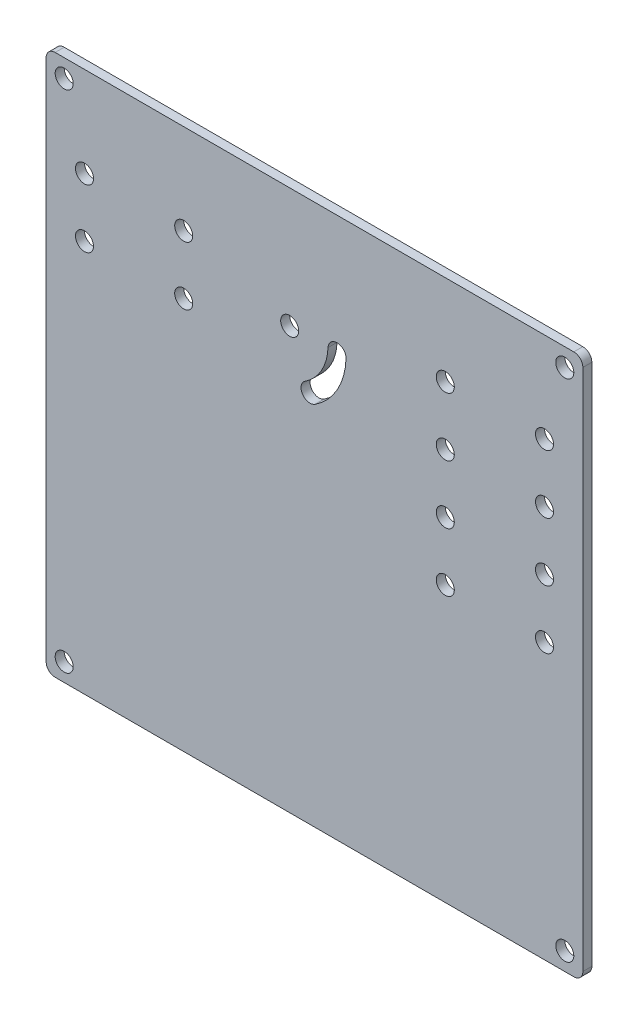
ISO-10303-21;
HEADER;
FILE_DESCRIPTION(('STEP AP214'),'2;1');
FILE_NAME('part.step','',(''),(''),'','','');
FILE_SCHEMA(('AUTOMOTIVE_DESIGN { 1 0 10303 214 1 1 1 1 }'));
ENDSEC;
DATA;
#1=APPLICATION_CONTEXT('core data for automotive mechanical design processes');
#2=APPLICATION_PROTOCOL_DEFINITION('international standard','automotive_design',2000,#1);
#3=PRODUCT_CONTEXT('',#1,'mechanical');
#4=PRODUCT('Part','Part','',(#3));
#5=PRODUCT_RELATED_PRODUCT_CATEGORY('part','',(#4));
#6=PRODUCT_DEFINITION_FORMATION('','',#4);
#7=PRODUCT_DEFINITION_CONTEXT('part definition',#1,'design');
#8=PRODUCT_DEFINITION('design','',#6,#7);
#9=PRODUCT_DEFINITION_SHAPE('','',#8);
#10=(LENGTH_UNIT() NAMED_UNIT(*) SI_UNIT(.MILLI.,.METRE.));
#11=(NAMED_UNIT(*) PLANE_ANGLE_UNIT() SI_UNIT($,.RADIAN.));
#12=(NAMED_UNIT(*) SI_UNIT($,.STERADIAN.) SOLID_ANGLE_UNIT());
#13=UNCERTAINTY_MEASURE_WITH_UNIT(LENGTH_MEASURE(1.E-05),#10,'distance_accuracy_value','');
#14=(GEOMETRIC_REPRESENTATION_CONTEXT(3) GLOBAL_UNCERTAINTY_ASSIGNED_CONTEXT((#13)) GLOBAL_UNIT_ASSIGNED_CONTEXT((#10,
#11,#12)) REPRESENTATION_CONTEXT('',''));
#15=CARTESIAN_POINT('',(0.,0.,0.));
#16=DIRECTION('',(0.,0.,1.));
#17=DIRECTION('',(1.,0.,0.));
#18=AXIS2_PLACEMENT_3D('',#15,#16,#17);
#19=CARTESIAN_POINT('',(0.,0.,2.));
#20=DIRECTION('',(0.,0.,-1.));
#21=DIRECTION('',(-1.,0.,0.));
#22=AXIS2_PLACEMENT_3D('',#19,#20,#21);
#23=PLANE('',#22);
#24=CARTESIAN_POINT('',(4.,116.,2.));
#25=DIRECTION('',(0.,0.,1.));
#26=DIRECTION('',(1.,0.,0.));
#27=AXIS2_PLACEMENT_3D('',#24,#25,#26);
#28=CIRCLE('',#27,2.);
#29=CARTESIAN_POINT('',(6.,116.,2.));
#30=VERTEX_POINT('',#29);
#31=EDGE_CURVE('E757',#30,#30,#28,.T.);
#32=ORIENTED_EDGE('',*,*,#31,.F.);
#33=EDGE_LOOP('',(#32));
#34=FACE_BOUND('',#33,.T.);
#35=CARTESIAN_POINT('',(115.,4.,2.));
#36=DIRECTION('',(0.,0.,1.));
#37=DIRECTION('',(1.,0.,0.));
#38=AXIS2_PLACEMENT_3D('',#35,#36,#37);
#39=CIRCLE('',#38,2.);
#40=CARTESIAN_POINT('',(117.,4.,2.));
#41=VERTEX_POINT('',#40);
#42=EDGE_CURVE('E761',#41,#41,#39,.T.);
#43=ORIENTED_EDGE('',*,*,#42,.F.);
#44=EDGE_LOOP('',(#43));
#45=FACE_BOUND('',#44,.T.);
#46=CARTESIAN_POINT('',(4.00000000000001,4.,2.));
#47=DIRECTION('',(0.,0.,1.));
#48=DIRECTION('',(1.,0.,0.));
#49=AXIS2_PLACEMENT_3D('',#46,#47,#48);
#50=CIRCLE('',#49,2.);
#51=CARTESIAN_POINT('',(6.00000000000001,4.,2.));
#52=VERTEX_POINT('',#51);
#53=EDGE_CURVE('E775',#52,#52,#50,.T.);
#54=ORIENTED_EDGE('',*,*,#53,.F.);
#55=EDGE_LOOP('',(#54));
#56=FACE_BOUND('',#55,.T.);
#57=CARTESIAN_POINT('',(115.,116.,2.));
#58=DIRECTION('',(0.,0.,1.));
#59=DIRECTION('',(1.,0.,0.));
#60=AXIS2_PLACEMENT_3D('',#57,#58,#59);
#61=CIRCLE('',#60,2.);
#62=CARTESIAN_POINT('',(117.,116.,2.));
#63=VERTEX_POINT('',#62);
#64=EDGE_CURVE('E767',#63,#63,#61,.T.);
#65=ORIENTED_EDGE('',*,*,#64,.F.);
#66=EDGE_LOOP('',(#65));
#67=FACE_BOUND('',#66,.T.);
#68=DIRECTION('',(0.,1.,0.));
#69=VECTOR('',#68,1.);
#70=CARTESIAN_POINT('',(119.,0.,2.));
#71=LINE('',#70,#69);
#72=CARTESIAN_POINT('',(119.,2.,2.));
#73=VERTEX_POINT('',#72);
#74=CARTESIAN_POINT('',(119.,118.,2.));
#75=VERTEX_POINT('',#74);
#76=EDGE_CURVE('E300',#73,#75,#71,.T.);
#77=ORIENTED_EDGE('',*,*,#76,.T.);
#78=CARTESIAN_POINT('',(117.,118.,2.));
#79=DIRECTION('',(0.,0.,-1.));
#80=DIRECTION('',(-1.,0.,0.));
#81=AXIS2_PLACEMENT_3D('',#78,#79,#80);
#82=CIRCLE('',#81,2.);
#83=CARTESIAN_POINT('',(117.,120.,2.));
#84=VERTEX_POINT('',#83);
#85=EDGE_CURVE('E354',#75,#84,#82,.F.);
#86=ORIENTED_EDGE('',*,*,#85,.T.);
#87=DIRECTION('',(1.,0.,0.));
#88=VECTOR('',#87,1.);
#89=CARTESIAN_POINT('',(0.,120.,2.));
#90=LINE('',#89,#88);
#91=CARTESIAN_POINT('',(2.,120.,2.));
#92=VERTEX_POINT('',#91);
#93=EDGE_CURVE('E295',#92,#84,#90,.T.);
#94=ORIENTED_EDGE('',*,*,#93,.F.);
#95=CARTESIAN_POINT('',(2.,118.,2.));
#96=DIRECTION('',(0.,0.,-1.));
#97=DIRECTION('',(-1.,0.,0.));
#98=AXIS2_PLACEMENT_3D('',#95,#96,#97);
#99=CIRCLE('',#98,2.);
#100=CARTESIAN_POINT('',(0.,118.,2.));
#101=VERTEX_POINT('',#100);
#102=EDGE_CURVE('E346',#92,#101,#99,.F.);
#103=ORIENTED_EDGE('',*,*,#102,.T.);
#104=DIRECTION('',(0.,1.,0.));
#105=VECTOR('',#104,1.);
#106=CARTESIAN_POINT('',(0.,0.,2.));
#107=LINE('',#106,#105);
#108=CARTESIAN_POINT('',(0.,2.,2.));
#109=VERTEX_POINT('',#108);
#110=EDGE_CURVE('E291',#109,#101,#107,.T.);
#111=ORIENTED_EDGE('',*,*,#110,.F.);
#112=CARTESIAN_POINT('',(2.,2.,2.));
#113=DIRECTION('',(0.,0.,-1.));
#114=DIRECTION('',(-1.,0.,0.));
#115=AXIS2_PLACEMENT_3D('',#112,#113,#114);
#116=CIRCLE('',#115,2.);
#117=CARTESIAN_POINT('',(2.,0.,2.));
#118=VERTEX_POINT('',#117);
#119=EDGE_CURVE('E63',#109,#118,#116,.F.);
#120=ORIENTED_EDGE('',*,*,#119,.T.);
#121=DIRECTION('',(1.,0.,0.));
#122=VECTOR('',#121,1.);
#123=CARTESIAN_POINT('',(0.,0.,2.));
#124=LINE('',#123,#122);
#125=CARTESIAN_POINT('',(117.,0.,2.));
#126=VERTEX_POINT('',#125);
#127=EDGE_CURVE('E304',#118,#126,#124,.T.);
#128=ORIENTED_EDGE('',*,*,#127,.T.);
#129=CARTESIAN_POINT('',(117.,2.,2.));
#130=DIRECTION('',(0.,0.,-1.));
#131=DIRECTION('',(-1.,0.,0.));
#132=AXIS2_PLACEMENT_3D('',#129,#130,#131);
#133=CIRCLE('',#132,2.);
#134=EDGE_CURVE('E351',#126,#73,#133,.F.);
#135=ORIENTED_EDGE('',*,*,#134,.T.);
#136=EDGE_LOOP('',(#77,#86,#94,#103,#111,#120,#128,#135));
#137=FACE_BOUND('',#136,.T.);
#138=CARTESIAN_POINT('',(8.5,100.,2.));
#139=DIRECTION('',(0.,0.,1.));
#140=DIRECTION('',(1.,0.,0.));
#141=AXIS2_PLACEMENT_3D('',#138,#139,#140);
#142=CIRCLE('',#141,2.);
#143=CARTESIAN_POINT('',(10.5,100.,2.));
#144=VERTEX_POINT('',#143);
#145=EDGE_CURVE('E283',#144,#144,#142,.T.);
#146=ORIENTED_EDGE('',*,*,#145,.F.);
#147=EDGE_LOOP('',(#146));
#148=FACE_BOUND('',#147,.T.);
#149=CARTESIAN_POINT('',(54.,93.5,2.));
#150=DIRECTION('',(0.,0.,1.));
#151=DIRECTION('',(1.,0.,0.));
#152=AXIS2_PLACEMENT_3D('',#149,#150,#151);
#153=CIRCLE('',#152,2.);
#154=CARTESIAN_POINT('',(56.,93.5,2.));
#155=VERTEX_POINT('',#154);
#156=EDGE_CURVE('E196',#155,#155,#153,.T.);
#157=ORIENTED_EDGE('',*,*,#156,.F.);
#158=EDGE_LOOP('',(#157));
#159=FACE_BOUND('',#158,.T.);
#160=CARTESIAN_POINT('',(30.5,87.,2.));
#161=DIRECTION('',(0.,0.,1.));
#162=DIRECTION('',(1.,0.,0.));
#163=AXIS2_PLACEMENT_3D('',#160,#161,#162);
#164=CIRCLE('',#163,2.);
#165=CARTESIAN_POINT('',(32.5,87.,2.));
#166=VERTEX_POINT('',#165);
#167=EDGE_CURVE('E187',#166,#166,#164,.T.);
#168=ORIENTED_EDGE('',*,*,#167,.F.);
#169=EDGE_LOOP('',(#168));
#170=FACE_BOUND('',#169,.T.);
#171=CARTESIAN_POINT('',(8.5,87.,2.));
#172=DIRECTION('',(0.,0.,1.));
#173=DIRECTION('',(1.,0.,0.));
#174=AXIS2_PLACEMENT_3D('',#171,#172,#173);
#175=CIRCLE('',#174,2.);
#176=CARTESIAN_POINT('',(10.5,87.,2.));
#177=VERTEX_POINT('',#176);
#178=EDGE_CURVE('E214',#177,#177,#175,.T.);
#179=ORIENTED_EDGE('',*,*,#178,.F.);
#180=EDGE_LOOP('',(#179));
#181=FACE_BOUND('',#180,.T.);
#182=CARTESIAN_POINT('',(30.5,100.,2.));
#183=DIRECTION('',(0.,0.,1.));
#184=DIRECTION('',(1.,0.,0.));
#185=AXIS2_PLACEMENT_3D('',#182,#183,#184);
#186=CIRCLE('',#185,2.);
#187=CARTESIAN_POINT('',(32.5,100.,2.));
#188=VERTEX_POINT('',#187);
#189=EDGE_CURVE('E205',#188,#188,#186,.T.);
#190=ORIENTED_EDGE('',*,*,#189,.F.);
#191=EDGE_LOOP('',(#190));
#192=FACE_BOUND('',#191,.T.);
#193=CARTESIAN_POINT('',(88.5,100.,2.));
#194=DIRECTION('',(0.,0.,1.));
#195=DIRECTION('',(1.,0.,0.));
#196=AXIS2_PLACEMENT_3D('',#193,#194,#195);
#197=CIRCLE('',#196,2.);
#198=CARTESIAN_POINT('',(90.5,100.,2.));
#199=VERTEX_POINT('',#198);
#200=EDGE_CURVE('E204',#199,#199,#197,.T.);
#201=ORIENTED_EDGE('',*,*,#200,.F.);
#202=EDGE_LOOP('',(#201));
#203=FACE_BOUND('',#202,.T.);
#204=CARTESIAN_POINT('',(88.5,87.,2.));
#205=DIRECTION('',(0.,0.,1.));
#206=DIRECTION('',(1.,0.,0.));
#207=AXIS2_PLACEMENT_3D('',#204,#205,#206);
#208=CIRCLE('',#207,2.);
#209=CARTESIAN_POINT('',(90.5,87.,2.));
#210=VERTEX_POINT('',#209);
#211=EDGE_CURVE('E228',#210,#210,#208,.T.);
#212=ORIENTED_EDGE('',*,*,#211,.F.);
#213=EDGE_LOOP('',(#212));
#214=FACE_BOUND('',#213,.T.);
#215=CARTESIAN_POINT('',(110.5,100.,2.));
#216=DIRECTION('',(0.,0.,1.));
#217=DIRECTION('',(1.,0.,0.));
#218=AXIS2_PLACEMENT_3D('',#215,#216,#217);
#219=CIRCLE('',#218,2.);
#220=CARTESIAN_POINT('',(112.5,100.,2.));
#221=VERTEX_POINT('',#220);
#222=EDGE_CURVE('E236',#221,#221,#219,.T.);
#223=ORIENTED_EDGE('',*,*,#222,.F.);
#224=EDGE_LOOP('',(#223));
#225=FACE_BOUND('',#224,.T.);
#226=CARTESIAN_POINT('',(110.5,87.,2.));
#227=DIRECTION('',(0.,0.,1.));
#228=DIRECTION('',(1.,0.,0.));
#229=AXIS2_PLACEMENT_3D('',#226,#227,#228);
#230=CIRCLE('',#229,2.);
#231=CARTESIAN_POINT('',(112.5,87.,2.));
#232=VERTEX_POINT('',#231);
#233=EDGE_CURVE('E244',#232,#232,#230,.T.);
#234=ORIENTED_EDGE('',*,*,#233,.F.);
#235=EDGE_LOOP('',(#234));
#236=FACE_BOUND('',#235,.T.);
#237=CARTESIAN_POINT('',(88.5,74.,2.));
#238=DIRECTION('',(0.,0.,1.));
#239=DIRECTION('',(1.,0.,0.));
#240=AXIS2_PLACEMENT_3D('',#237,#238,#239);
#241=CIRCLE('',#240,2.);
#242=CARTESIAN_POINT('',(90.5,74.,2.));
#243=VERTEX_POINT('',#242);
#244=EDGE_CURVE('E252',#243,#243,#241,.T.);
#245=ORIENTED_EDGE('',*,*,#244,.F.);
#246=EDGE_LOOP('',(#245));
#247=FACE_BOUND('',#246,.T.);
#248=CARTESIAN_POINT('',(88.5,61.,2.));
#249=DIRECTION('',(0.,0.,1.));
#250=DIRECTION('',(1.,0.,0.));
#251=AXIS2_PLACEMENT_3D('',#248,#249,#250);
#252=CIRCLE('',#251,2.);
#253=CARTESIAN_POINT('',(90.5,61.,2.));
#254=VERTEX_POINT('',#253);
#255=EDGE_CURVE('E260',#254,#254,#252,.T.);
#256=ORIENTED_EDGE('',*,*,#255,.F.);
#257=EDGE_LOOP('',(#256));
#258=FACE_BOUND('',#257,.T.);
#259=CARTESIAN_POINT('',(110.5,74.,2.));
#260=DIRECTION('',(0.,0.,1.));
#261=DIRECTION('',(1.,0.,0.));
#262=AXIS2_PLACEMENT_3D('',#259,#260,#261);
#263=CIRCLE('',#262,2.);
#264=CARTESIAN_POINT('',(112.5,74.,2.));
#265=VERTEX_POINT('',#264);
#266=EDGE_CURVE('E268',#265,#265,#263,.T.);
#267=ORIENTED_EDGE('',*,*,#266,.F.);
#268=EDGE_LOOP('',(#267));
#269=FACE_BOUND('',#268,.T.);
#270=CARTESIAN_POINT('',(110.5,61.,2.));
#271=DIRECTION('',(0.,0.,1.));
#272=DIRECTION('',(1.,0.,0.));
#273=AXIS2_PLACEMENT_3D('',#270,#271,#272);
#274=CIRCLE('',#273,2.);
#275=CARTESIAN_POINT('',(112.5,61.,2.));
#276=VERTEX_POINT('',#275);
#277=EDGE_CURVE('E276',#276,#276,#274,.T.);
#278=ORIENTED_EDGE('',*,*,#277,.F.);
#279=EDGE_LOOP('',(#278));
#280=FACE_BOUND('',#279,.T.);
#281=CARTESIAN_POINT('',(58.5211331715895,82.905441538271,2.));
#282=DIRECTION('',(0.,0.,1.));
#283=DIRECTION('',(1.,0.,0.));
#284=AXIS2_PLACEMENT_3D('',#281,#282,#283);
#285=CIRCLE('',#284,2.);
#286=CARTESIAN_POINT('',(57.4241250793313,84.5777373391149,2.));
#287=VERTEX_POINT('',#286);
#288=CARTESIAN_POINT('',(59.6181412638477,81.2331457374271,2.));
#289=VERTEX_POINT('',#288);
#290=EDGE_CURVE('E132',#287,#289,#285,.T.);
#291=ORIENTED_EDGE('',*,*,#290,.F.);
#292=CARTESIAN_POINT('',(51.2464197735433,93.9951251547819,2.));
#293=DIRECTION('',(0.,0.,-1.));
#294=DIRECTION('',(1.,0.,0.));
#295=AXIS2_PLACEMENT_3D('',#292,#293,#294);
#296=CIRCLE('',#295,11.262825405547);
#297=CARTESIAN_POINT('',(62.5013941492567,93.5746636014035,2.));
#298=VERTEX_POINT('',#297);
#299=EDGE_CURVE('E161',#298,#287,#296,.T.);
#300=ORIENTED_EDGE('',*,*,#299,.F.);
#301=CARTESIAN_POINT('',(64.5,93.5,2.));
#302=DIRECTION('',(0.,0.,1.));
#303=DIRECTION('',(-1.,0.,0.));
#304=AXIS2_PLACEMENT_3D('',#301,#302,#303);
#305=CIRCLE('',#304,2.);
#306=CARTESIAN_POINT('',(66.4986058507433,93.4253363985965,2.));
#307=VERTEX_POINT('',#306);
#308=EDGE_CURVE('E157',#307,#298,#305,.T.);
#309=ORIENTED_EDGE('',*,*,#308,.F.);
#310=CARTESIAN_POINT('',(51.2464197735433,93.9951251547819,2.));
#311=DIRECTION('',(0.,0.,1.));
#312=DIRECTION('',(1.,0.,0.));
#313=AXIS2_PLACEMENT_3D('',#310,#311,#312);
#314=CIRCLE('',#313,15.262825405547);
#315=EDGE_CURVE('E143',#289,#307,#314,.T.);
#316=ORIENTED_EDGE('',*,*,#315,.F.);
#317=EDGE_LOOP('',(#291,#300,#309,#316));
#318=FACE_BOUND('',#317,.T.);
#319=ADVANCED_FACE('F40',(#34,#45,#56,#67,#137,#148,#159,#170,#181,#192,#203,#214,#225,#236,
#247,#258,#269,#280,#318),#23,.F.);
#320=CARTESIAN_POINT('',(0.,0.,0.));
#321=DIRECTION('',(0.,0.,-1.));
#322=DIRECTION('',(-1.,0.,0.));
#323=AXIS2_PLACEMENT_3D('',#320,#321,#322);
#324=PLANE('',#323);
#325=CARTESIAN_POINT('',(4.,116.,0.));
#326=DIRECTION('',(0.,0.,1.));
#327=DIRECTION('',(1.,0.,0.));
#328=AXIS2_PLACEMENT_3D('',#325,#326,#327);
#329=CIRCLE('',#328,2.);
#330=CARTESIAN_POINT('',(6.,116.,0.));
#331=VERTEX_POINT('',#330);
#332=EDGE_CURVE('E755',#331,#331,#329,.T.);
#333=ORIENTED_EDGE('',*,*,#332,.T.);
#334=EDGE_LOOP('',(#333));
#335=FACE_BOUND('',#334,.T.);
#336=CARTESIAN_POINT('',(115.,4.,0.));
#337=DIRECTION('',(0.,0.,1.));
#338=DIRECTION('',(1.,0.,0.));
#339=AXIS2_PLACEMENT_3D('',#336,#337,#338);
#340=CIRCLE('',#339,2.);
#341=CARTESIAN_POINT('',(117.,4.,0.));
#342=VERTEX_POINT('',#341);
#343=EDGE_CURVE('E781',#342,#342,#340,.T.);
#344=ORIENTED_EDGE('',*,*,#343,.T.);
#345=EDGE_LOOP('',(#344));
#346=FACE_BOUND('',#345,.T.);
#347=CARTESIAN_POINT('',(4.00000000000001,4.,0.));
#348=DIRECTION('',(0.,0.,1.));
#349=DIRECTION('',(1.,0.,0.));
#350=AXIS2_PLACEMENT_3D('',#347,#348,#349);
#351=CIRCLE('',#350,2.);
#352=CARTESIAN_POINT('',(6.00000000000001,4.,0.));
#353=VERTEX_POINT('',#352);
#354=EDGE_CURVE('E770',#353,#353,#351,.T.);
#355=ORIENTED_EDGE('',*,*,#354,.T.);
#356=EDGE_LOOP('',(#355));
#357=FACE_BOUND('',#356,.T.);
#358=CARTESIAN_POINT('',(115.,116.,0.));
#359=DIRECTION('',(0.,0.,1.));
#360=DIRECTION('',(1.,0.,0.));
#361=AXIS2_PLACEMENT_3D('',#358,#359,#360);
#362=CIRCLE('',#361,2.);
#363=CARTESIAN_POINT('',(117.,116.,0.));
#364=VERTEX_POINT('',#363);
#365=EDGE_CURVE('E170',#364,#364,#362,.T.);
#366=ORIENTED_EDGE('',*,*,#365,.T.);
#367=EDGE_LOOP('',(#366));
#368=FACE_BOUND('',#367,.T.);
#369=CARTESIAN_POINT('',(110.5,61.,0.));
#370=DIRECTION('',(0.,0.,1.));
#371=DIRECTION('',(1.,0.,0.));
#372=AXIS2_PLACEMENT_3D('',#369,#370,#371);
#373=CIRCLE('',#372,2.);
#374=CARTESIAN_POINT('',(112.5,61.,0.));
#375=VERTEX_POINT('',#374);
#376=EDGE_CURVE('E152',#375,#375,#373,.T.);
#377=ORIENTED_EDGE('',*,*,#376,.T.);
#378=EDGE_LOOP('',(#377));
#379=FACE_BOUND('',#378,.T.);
#380=CARTESIAN_POINT('',(110.5,74.,0.));
#381=DIRECTION('',(0.,0.,1.));
#382=DIRECTION('',(1.,0.,0.));
#383=AXIS2_PLACEMENT_3D('',#380,#381,#382);
#384=CIRCLE('',#383,2.);
#385=CARTESIAN_POINT('',(112.5,74.,0.));
#386=VERTEX_POINT('',#385);
#387=EDGE_CURVE('E272',#386,#386,#384,.T.);
#388=ORIENTED_EDGE('',*,*,#387,.T.);
#389=EDGE_LOOP('',(#388));
#390=FACE_BOUND('',#389,.T.);
#391=CARTESIAN_POINT('',(88.5,61.,0.));
#392=DIRECTION('',(0.,0.,1.));
#393=DIRECTION('',(1.,0.,0.));
#394=AXIS2_PLACEMENT_3D('',#391,#392,#393);
#395=CIRCLE('',#394,2.);
#396=CARTESIAN_POINT('',(90.5,61.,0.));
#397=VERTEX_POINT('',#396);
#398=EDGE_CURVE('E264',#397,#397,#395,.T.);
#399=ORIENTED_EDGE('',*,*,#398,.T.);
#400=EDGE_LOOP('',(#399));
#401=FACE_BOUND('',#400,.T.);
#402=CARTESIAN_POINT('',(88.5,74.,0.));
#403=DIRECTION('',(0.,0.,1.));
#404=DIRECTION('',(1.,0.,0.));
#405=AXIS2_PLACEMENT_3D('',#402,#403,#404);
#406=CIRCLE('',#405,2.);
#407=CARTESIAN_POINT('',(90.5,74.,0.));
#408=VERTEX_POINT('',#407);
#409=EDGE_CURVE('E256',#408,#408,#406,.T.);
#410=ORIENTED_EDGE('',*,*,#409,.T.);
#411=EDGE_LOOP('',(#410));
#412=FACE_BOUND('',#411,.T.);
#413=CARTESIAN_POINT('',(110.5,87.,0.));
#414=DIRECTION('',(0.,0.,1.));
#415=DIRECTION('',(1.,0.,0.));
#416=AXIS2_PLACEMENT_3D('',#413,#414,#415);
#417=CIRCLE('',#416,2.);
#418=CARTESIAN_POINT('',(112.5,87.,0.));
#419=VERTEX_POINT('',#418);
#420=EDGE_CURVE('E248',#419,#419,#417,.T.);
#421=ORIENTED_EDGE('',*,*,#420,.T.);
#422=EDGE_LOOP('',(#421));
#423=FACE_BOUND('',#422,.T.);
#424=CARTESIAN_POINT('',(110.5,100.,0.));
#425=DIRECTION('',(0.,0.,1.));
#426=DIRECTION('',(1.,0.,0.));
#427=AXIS2_PLACEMENT_3D('',#424,#425,#426);
#428=CIRCLE('',#427,2.);
#429=CARTESIAN_POINT('',(112.5,100.,0.));
#430=VERTEX_POINT('',#429);
#431=EDGE_CURVE('E240',#430,#430,#428,.T.);
#432=ORIENTED_EDGE('',*,*,#431,.T.);
#433=EDGE_LOOP('',(#432));
#434=FACE_BOUND('',#433,.T.);
#435=CARTESIAN_POINT('',(88.5,87.,0.));
#436=DIRECTION('',(0.,0.,1.));
#437=DIRECTION('',(1.,0.,0.));
#438=AXIS2_PLACEMENT_3D('',#435,#436,#437);
#439=CIRCLE('',#438,2.);
#440=CARTESIAN_POINT('',(90.5,87.,0.));
#441=VERTEX_POINT('',#440);
#442=EDGE_CURVE('E232',#441,#441,#439,.T.);
#443=ORIENTED_EDGE('',*,*,#442,.T.);
#444=EDGE_LOOP('',(#443));
#445=FACE_BOUND('',#444,.T.);
#446=CARTESIAN_POINT('',(88.5,100.,0.));
#447=DIRECTION('',(0.,0.,1.));
#448=DIRECTION('',(1.,0.,0.));
#449=AXIS2_PLACEMENT_3D('',#446,#447,#448);
#450=CIRCLE('',#449,2.);
#451=CARTESIAN_POINT('',(90.5,100.,0.));
#452=VERTEX_POINT('',#451);
#453=EDGE_CURVE('E224',#452,#452,#450,.T.);
#454=ORIENTED_EDGE('',*,*,#453,.T.);
#455=EDGE_LOOP('',(#454));
#456=FACE_BOUND('',#455,.T.);
#457=CARTESIAN_POINT('',(30.5,100.,0.));
#458=DIRECTION('',(0.,0.,1.));
#459=DIRECTION('',(1.,0.,0.));
#460=AXIS2_PLACEMENT_3D('',#457,#458,#459);
#461=CIRCLE('',#460,2.);
#462=CARTESIAN_POINT('',(32.5,100.,0.));
#463=VERTEX_POINT('',#462);
#464=EDGE_CURVE('E210',#463,#463,#461,.T.);
#465=ORIENTED_EDGE('',*,*,#464,.T.);
#466=EDGE_LOOP('',(#465));
#467=FACE_BOUND('',#466,.T.);
#468=CARTESIAN_POINT('',(8.5,87.,0.));
#469=DIRECTION('',(0.,0.,1.));
#470=DIRECTION('',(1.,0.,0.));
#471=AXIS2_PLACEMENT_3D('',#468,#469,#470);
#472=CIRCLE('',#471,2.);
#473=CARTESIAN_POINT('',(10.5,87.,0.));
#474=VERTEX_POINT('',#473);
#475=EDGE_CURVE('E191',#474,#474,#472,.T.);
#476=ORIENTED_EDGE('',*,*,#475,.T.);
#477=EDGE_LOOP('',(#476));
#478=FACE_BOUND('',#477,.T.);
#479=CARTESIAN_POINT('',(30.5,87.,0.));
#480=DIRECTION('',(0.,0.,1.));
#481=DIRECTION('',(1.,0.,0.));
#482=AXIS2_PLACEMENT_3D('',#479,#480,#481);
#483=CIRCLE('',#482,2.);
#484=CARTESIAN_POINT('',(32.5,87.,0.));
#485=VERTEX_POINT('',#484);
#486=EDGE_CURVE('E192',#485,#485,#483,.T.);
#487=ORIENTED_EDGE('',*,*,#486,.T.);
#488=EDGE_LOOP('',(#487));
#489=FACE_BOUND('',#488,.T.);
#490=CARTESIAN_POINT('',(54.,93.5,0.));
#491=DIRECTION('',(0.,0.,1.));
#492=DIRECTION('',(1.,0.,0.));
#493=AXIS2_PLACEMENT_3D('',#490,#491,#492);
#494=CIRCLE('',#493,2.);
#495=CARTESIAN_POINT('',(56.,93.5,0.));
#496=VERTEX_POINT('',#495);
#497=EDGE_CURVE('E200',#496,#496,#494,.T.);
#498=ORIENTED_EDGE('',*,*,#497,.T.);
#499=EDGE_LOOP('',(#498));
#500=FACE_BOUND('',#499,.T.);
#501=CARTESIAN_POINT('',(8.5,100.,0.));
#502=DIRECTION('',(0.,0.,1.));
#503=DIRECTION('',(1.,0.,0.));
#504=AXIS2_PLACEMENT_3D('',#501,#502,#503);
#505=CIRCLE('',#504,2.);
#506=CARTESIAN_POINT('',(10.5,100.,0.));
#507=VERTEX_POINT('',#506);
#508=EDGE_CURVE('E209',#507,#507,#505,.T.);
#509=ORIENTED_EDGE('',*,*,#508,.T.);
#510=EDGE_LOOP('',(#509));
#511=FACE_BOUND('',#510,.T.);
#512=DIRECTION('',(1.,0.,0.));
#513=VECTOR('',#512,1.);
#514=CARTESIAN_POINT('',(0.,120.,0.));
#515=LINE('',#514,#513);
#516=CARTESIAN_POINT('',(2.,120.,0.));
#517=VERTEX_POINT('',#516);
#518=CARTESIAN_POINT('',(117.,120.,0.));
#519=VERTEX_POINT('',#518);
#520=EDGE_CURVE('E311',#517,#519,#515,.T.);
#521=ORIENTED_EDGE('',*,*,#520,.T.);
#522=CARTESIAN_POINT('',(117.,118.,0.));
#523=DIRECTION('',(0.,0.,-1.));
#524=DIRECTION('',(-1.,0.,0.));
#525=AXIS2_PLACEMENT_3D('',#522,#523,#524);
#526=CIRCLE('',#525,2.);
#527=CARTESIAN_POINT('',(119.,118.,0.));
#528=VERTEX_POINT('',#527);
#529=EDGE_CURVE('E336',#519,#528,#526,.T.);
#530=ORIENTED_EDGE('',*,*,#529,.T.);
#531=DIRECTION('',(0.,1.,0.));
#532=VECTOR('',#531,1.);
#533=CARTESIAN_POINT('',(119.,0.,0.));
#534=LINE('',#533,#532);
#535=CARTESIAN_POINT('',(119.,2.,0.));
#536=VERTEX_POINT('',#535);
#537=EDGE_CURVE('E315',#536,#528,#534,.T.);
#538=ORIENTED_EDGE('',*,*,#537,.F.);
#539=CARTESIAN_POINT('',(117.,2.,0.));
#540=DIRECTION('',(0.,0.,-1.));
#541=DIRECTION('',(-1.,0.,0.));
#542=AXIS2_PLACEMENT_3D('',#539,#540,#541);
#543=CIRCLE('',#542,2.);
#544=CARTESIAN_POINT('',(117.,0.,0.));
#545=VERTEX_POINT('',#544);
#546=EDGE_CURVE('E333',#536,#545,#543,.T.);
#547=ORIENTED_EDGE('',*,*,#546,.T.);
#548=DIRECTION('',(1.,0.,0.));
#549=VECTOR('',#548,1.);
#550=CARTESIAN_POINT('',(0.,0.,0.));
#551=LINE('',#550,#549);
#552=CARTESIAN_POINT('',(2.,0.,0.));
#553=VERTEX_POINT('',#552);
#554=EDGE_CURVE('E296',#553,#545,#551,.T.);
#555=ORIENTED_EDGE('',*,*,#554,.F.);
#556=CARTESIAN_POINT('',(2.,2.,0.));
#557=DIRECTION('',(0.,0.,-1.));
#558=DIRECTION('',(-1.,0.,0.));
#559=AXIS2_PLACEMENT_3D('',#556,#557,#558);
#560=CIRCLE('',#559,2.);
#561=CARTESIAN_POINT('',(0.,2.,0.));
#562=VERTEX_POINT('',#561);
#563=EDGE_CURVE('E330',#553,#562,#560,.T.);
#564=ORIENTED_EDGE('',*,*,#563,.T.);
#565=DIRECTION('',(0.,1.,0.));
#566=VECTOR('',#565,1.);
#567=CARTESIAN_POINT('',(0.,0.,0.));
#568=LINE('',#567,#566);
#569=CARTESIAN_POINT('',(0.,118.,0.));
#570=VERTEX_POINT('',#569);
#571=EDGE_CURVE('E287',#562,#570,#568,.T.);
#572=ORIENTED_EDGE('',*,*,#571,.T.);
#573=CARTESIAN_POINT('',(2.,118.,0.));
#574=DIRECTION('',(0.,0.,-1.));
#575=DIRECTION('',(-1.,0.,0.));
#576=AXIS2_PLACEMENT_3D('',#573,#574,#575);
#577=CIRCLE('',#576,2.);
#578=EDGE_CURVE('E327',#570,#517,#577,.T.);
#579=ORIENTED_EDGE('',*,*,#578,.T.);
#580=EDGE_LOOP('',(#521,#530,#538,#547,#555,#564,#572,#579));
#581=FACE_BOUND('',#580,.T.);
#582=CARTESIAN_POINT('',(51.2464197735433,93.9951251547819,0.));
#583=DIRECTION('',(0.,0.,-1.));
#584=DIRECTION('',(1.,0.,0.));
#585=AXIS2_PLACEMENT_3D('',#582,#583,#584);
#586=CIRCLE('',#585,11.262825405547);
#587=CARTESIAN_POINT('',(62.5013941492567,93.5746636014035,0.));
#588=VERTEX_POINT('',#587);
#589=CARTESIAN_POINT('',(57.4241250793313,84.5777373391149,0.));
#590=VERTEX_POINT('',#589);
#591=EDGE_CURVE('E144',#588,#590,#586,.T.);
#592=ORIENTED_EDGE('',*,*,#591,.T.);
#593=CARTESIAN_POINT('',(58.5211331715895,82.905441538271,0.));
#594=DIRECTION('',(0.,0.,1.));
#595=DIRECTION('',(1.,0.,0.));
#596=AXIS2_PLACEMENT_3D('',#593,#594,#595);
#597=CIRCLE('',#596,2.);
#598=CARTESIAN_POINT('',(59.6181412638477,81.2331457374271,0.));
#599=VERTEX_POINT('',#598);
#600=EDGE_CURVE('E167',#590,#599,#597,.T.);
#601=ORIENTED_EDGE('',*,*,#600,.T.);
#602=CARTESIAN_POINT('',(51.2464197735433,93.9951251547819,0.));
#603=DIRECTION('',(0.,0.,1.));
#604=DIRECTION('',(1.,0.,0.));
#605=AXIS2_PLACEMENT_3D('',#602,#603,#604);
#606=CIRCLE('',#605,15.262825405547);
#607=CARTESIAN_POINT('',(66.4986058507433,93.4253363985965,0.));
#608=VERTEX_POINT('',#607);
#609=EDGE_CURVE('E150',#599,#608,#606,.T.);
#610=ORIENTED_EDGE('',*,*,#609,.T.);
#611=CARTESIAN_POINT('',(64.5,93.5,0.));
#612=DIRECTION('',(0.,0.,1.));
#613=DIRECTION('',(-1.,0.,0.));
#614=AXIS2_PLACEMENT_3D('',#611,#612,#613);
#615=CIRCLE('',#614,2.);
#616=EDGE_CURVE('E173',#608,#588,#615,.T.);
#617=ORIENTED_EDGE('',*,*,#616,.T.);
#618=EDGE_LOOP('',(#592,#601,#610,#617));
#619=FACE_BOUND('',#618,.T.);
#620=ADVANCED_FACE('F372',(#335,#346,#357,#368,#379,#390,#401,#412,#423,#434,#445,#456,#467,
#478,#489,#500,#511,#581,#619),#324,.T.);
#621=CARTESIAN_POINT('',(0.,0.,2.));
#622=DIRECTION('',(-1.,0.,0.));
#623=DIRECTION('',(0.,0.,1.));
#624=AXIS2_PLACEMENT_3D('',#621,#622,#623);
#625=PLANE('',#624);
#626=ORIENTED_EDGE('',*,*,#571,.F.);
#627=DIRECTION('',(0.,0.,-1.));
#628=VECTOR('',#627,1.);
#629=CARTESIAN_POINT('',(0.,2.,2.));
#630=LINE('',#629,#628);
#631=EDGE_CURVE('E11',#562,#109,#630,.F.);
#632=ORIENTED_EDGE('',*,*,#631,.T.);
#633=ORIENTED_EDGE('',*,*,#110,.T.);
#634=DIRECTION('',(0.,0.,-1.));
#635=VECTOR('',#634,1.);
#636=CARTESIAN_POINT('',(0.,118.,2.));
#637=LINE('',#636,#635);
#638=EDGE_CURVE('E49',#101,#570,#637,.T.);
#639=ORIENTED_EDGE('',*,*,#638,.T.);
#640=EDGE_LOOP('',(#626,#632,#633,#639));
#641=FACE_BOUND('',#640,.T.);
#642=ADVANCED_FACE('F367',(#641),#625,.T.);
#643=CARTESIAN_POINT('',(0.,0.,2.));
#644=DIRECTION('',(0.,1.,0.));
#645=DIRECTION('',(0.,0.,1.));
#646=AXIS2_PLACEMENT_3D('',#643,#644,#645);
#647=PLANE('',#646);
#648=ORIENTED_EDGE('',*,*,#554,.T.);
#649=DIRECTION('',(0.,0.,-1.));
#650=VECTOR('',#649,1.);
#651=CARTESIAN_POINT('',(117.,0.,2.));
#652=LINE('',#651,#650);
#653=EDGE_CURVE('E56',#545,#126,#652,.F.);
#654=ORIENTED_EDGE('',*,*,#653,.T.);
#655=ORIENTED_EDGE('',*,*,#127,.F.);
#656=DIRECTION('',(0.,0.,-1.));
#657=VECTOR('',#656,1.);
#658=CARTESIAN_POINT('',(2.,0.,0.));
#659=LINE('',#658,#657);
#660=EDGE_CURVE('E357',#118,#553,#659,.T.);
#661=ORIENTED_EDGE('',*,*,#660,.T.);
#662=EDGE_LOOP('',(#648,#654,#655,#661));
#663=FACE_BOUND('',#662,.T.);
#664=ADVANCED_FACE('F379',(#663),#647,.F.);
#665=CARTESIAN_POINT('',(119.,0.,2.));
#666=DIRECTION('',(-1.,0.,0.));
#667=DIRECTION('',(0.,0.,1.));
#668=AXIS2_PLACEMENT_3D('',#665,#666,#667);
#669=PLANE('',#668);
#670=ORIENTED_EDGE('',*,*,#537,.T.);
#671=DIRECTION('',(0.,0.,-1.));
#672=VECTOR('',#671,1.);
#673=CARTESIAN_POINT('',(119.,118.,2.));
#674=LINE('',#673,#672);
#675=EDGE_CURVE('E343',#528,#75,#674,.F.);
#676=ORIENTED_EDGE('',*,*,#675,.T.);
#677=ORIENTED_EDGE('',*,*,#76,.F.);
#678=DIRECTION('',(0.,0.,-1.));
#679=VECTOR('',#678,1.);
#680=CARTESIAN_POINT('',(119.,2.,2.));
#681=LINE('',#680,#679);
#682=EDGE_CURVE('E339',#73,#536,#681,.T.);
#683=ORIENTED_EDGE('',*,*,#682,.T.);
#684=EDGE_LOOP('',(#670,#676,#677,#683));
#685=FACE_BOUND('',#684,.T.);
#686=ADVANCED_FACE('F388',(#685),#669,.F.);
#687=CARTESIAN_POINT('',(0.,120.,2.));
#688=DIRECTION('',(0.,1.,0.));
#689=DIRECTION('',(0.,0.,1.));
#690=AXIS2_PLACEMENT_3D('',#687,#688,#689);
#691=PLANE('',#690);
#692=ORIENTED_EDGE('',*,*,#93,.T.);
#693=DIRECTION('',(0.,0.,-1.));
#694=VECTOR('',#693,1.);
#695=CARTESIAN_POINT('',(117.,120.,0.));
#696=LINE('',#695,#694);
#697=EDGE_CURVE('E323',#84,#519,#696,.T.);
#698=ORIENTED_EDGE('',*,*,#697,.T.);
#699=ORIENTED_EDGE('',*,*,#520,.F.);
#700=DIRECTION('',(0.,0.,-1.));
#701=VECTOR('',#700,1.);
#702=CARTESIAN_POINT('',(2.,120.,2.));
#703=LINE('',#702,#701);
#704=EDGE_CURVE('E307',#517,#92,#703,.F.);
#705=ORIENTED_EDGE('',*,*,#704,.T.);
#706=EDGE_LOOP('',(#692,#698,#699,#705));
#707=FACE_BOUND('',#706,.T.);
#708=ADVANCED_FACE('F395',(#707),#691,.T.);
#709=CARTESIAN_POINT('',(8.5,100.,2.));
#710=DIRECTION('',(0.,0.,-1.));
#711=DIRECTION('',(-1.,0.,0.));
#712=AXIS2_PLACEMENT_3D('',#709,#710,#711);
#713=CYLINDRICAL_SURFACE('',#712,2.);
#714=ORIENTED_EDGE('',*,*,#145,.T.);
#715=EDGE_LOOP('',(#714));
#716=FACE_BOUND('',#715,.T.);
#717=ORIENTED_EDGE('',*,*,#508,.F.);
#718=EDGE_LOOP('',(#717));
#719=FACE_BOUND('',#718,.T.);
#720=ADVANCED_FACE('F418',(#716,#719),#713,.F.);
#721=CARTESIAN_POINT('',(54.,93.5,2.));
#722=DIRECTION('',(0.,0.,-1.));
#723=DIRECTION('',(-1.,0.,0.));
#724=AXIS2_PLACEMENT_3D('',#721,#722,#723);
#725=CYLINDRICAL_SURFACE('',#724,2.);
#726=ORIENTED_EDGE('',*,*,#156,.T.);
#727=EDGE_LOOP('',(#726));
#728=FACE_BOUND('',#727,.T.);
#729=ORIENTED_EDGE('',*,*,#497,.F.);
#730=EDGE_LOOP('',(#729));
#731=FACE_BOUND('',#730,.T.);
#732=ADVANCED_FACE('F515',(#728,#731),#725,.F.);
#733=CARTESIAN_POINT('',(30.5,87.,2.));
#734=DIRECTION('',(0.,0.,-1.));
#735=DIRECTION('',(-1.,0.,0.));
#736=AXIS2_PLACEMENT_3D('',#733,#734,#735);
#737=CYLINDRICAL_SURFACE('',#736,2.);
#738=ORIENTED_EDGE('',*,*,#167,.T.);
#739=EDGE_LOOP('',(#738));
#740=FACE_BOUND('',#739,.T.);
#741=ORIENTED_EDGE('',*,*,#486,.F.);
#742=EDGE_LOOP('',(#741));
#743=FACE_BOUND('',#742,.T.);
#744=ADVANCED_FACE('F511',(#740,#743),#737,.F.);
#745=CARTESIAN_POINT('',(8.5,87.,2.));
#746=DIRECTION('',(0.,0.,-1.));
#747=DIRECTION('',(-1.,0.,0.));
#748=AXIS2_PLACEMENT_3D('',#745,#746,#747);
#749=CYLINDRICAL_SURFACE('',#748,2.);
#750=ORIENTED_EDGE('',*,*,#178,.T.);
#751=EDGE_LOOP('',(#750));
#752=FACE_BOUND('',#751,.T.);
#753=ORIENTED_EDGE('',*,*,#475,.F.);
#754=EDGE_LOOP('',(#753));
#755=FACE_BOUND('',#754,.T.);
#756=ADVANCED_FACE('F514',(#752,#755),#749,.F.);
#757=CARTESIAN_POINT('',(30.5,100.,2.));
#758=DIRECTION('',(0.,0.,-1.));
#759=DIRECTION('',(-1.,0.,0.));
#760=AXIS2_PLACEMENT_3D('',#757,#758,#759);
#761=CYLINDRICAL_SURFACE('',#760,2.);
#762=ORIENTED_EDGE('',*,*,#189,.T.);
#763=EDGE_LOOP('',(#762));
#764=FACE_BOUND('',#763,.T.);
#765=ORIENTED_EDGE('',*,*,#464,.F.);
#766=EDGE_LOOP('',(#765));
#767=FACE_BOUND('',#766,.T.);
#768=ADVANCED_FACE('F520',(#764,#767),#761,.F.);
#769=CARTESIAN_POINT('',(88.5,100.,2.));
#770=DIRECTION('',(0.,0.,-1.));
#771=DIRECTION('',(-1.,0.,0.));
#772=AXIS2_PLACEMENT_3D('',#769,#770,#771);
#773=CYLINDRICAL_SURFACE('',#772,2.);
#774=ORIENTED_EDGE('',*,*,#200,.T.);
#775=EDGE_LOOP('',(#774));
#776=FACE_BOUND('',#775,.T.);
#777=ORIENTED_EDGE('',*,*,#453,.F.);
#778=EDGE_LOOP('',(#777));
#779=FACE_BOUND('',#778,.T.);
#780=ADVANCED_FACE('F523',(#776,#779),#773,.F.);
#781=CARTESIAN_POINT('',(88.5,87.,2.));
#782=DIRECTION('',(0.,0.,-1.));
#783=DIRECTION('',(-1.,0.,0.));
#784=AXIS2_PLACEMENT_3D('',#781,#782,#783);
#785=CYLINDRICAL_SURFACE('',#784,2.);
#786=ORIENTED_EDGE('',*,*,#211,.T.);
#787=EDGE_LOOP('',(#786));
#788=FACE_BOUND('',#787,.T.);
#789=ORIENTED_EDGE('',*,*,#442,.F.);
#790=EDGE_LOOP('',(#789));
#791=FACE_BOUND('',#790,.T.);
#792=ADVANCED_FACE('F530',(#788,#791),#785,.F.);
#793=CARTESIAN_POINT('',(110.5,100.,2.));
#794=DIRECTION('',(0.,0.,-1.));
#795=DIRECTION('',(-1.,0.,0.));
#796=AXIS2_PLACEMENT_3D('',#793,#794,#795);
#797=CYLINDRICAL_SURFACE('',#796,2.);
#798=ORIENTED_EDGE('',*,*,#222,.T.);
#799=EDGE_LOOP('',(#798));
#800=FACE_BOUND('',#799,.T.);
#801=ORIENTED_EDGE('',*,*,#431,.F.);
#802=EDGE_LOOP('',(#801));
#803=FACE_BOUND('',#802,.T.);
#804=ADVANCED_FACE('F534',(#800,#803),#797,.F.);
#805=CARTESIAN_POINT('',(110.5,87.,2.));
#806=DIRECTION('',(0.,0.,-1.));
#807=DIRECTION('',(-1.,0.,0.));
#808=AXIS2_PLACEMENT_3D('',#805,#806,#807);
#809=CYLINDRICAL_SURFACE('',#808,2.);
#810=ORIENTED_EDGE('',*,*,#233,.T.);
#811=EDGE_LOOP('',(#810));
#812=FACE_BOUND('',#811,.T.);
#813=ORIENTED_EDGE('',*,*,#420,.F.);
#814=EDGE_LOOP('',(#813));
#815=FACE_BOUND('',#814,.T.);
#816=ADVANCED_FACE('F538',(#812,#815),#809,.F.);
#817=CARTESIAN_POINT('',(88.5,74.,2.));
#818=DIRECTION('',(0.,0.,-1.));
#819=DIRECTION('',(-1.,0.,0.));
#820=AXIS2_PLACEMENT_3D('',#817,#818,#819);
#821=CYLINDRICAL_SURFACE('',#820,2.);
#822=ORIENTED_EDGE('',*,*,#244,.T.);
#823=EDGE_LOOP('',(#822));
#824=FACE_BOUND('',#823,.T.);
#825=ORIENTED_EDGE('',*,*,#409,.F.);
#826=EDGE_LOOP('',(#825));
#827=FACE_BOUND('',#826,.T.);
#828=ADVANCED_FACE('F542',(#824,#827),#821,.F.);
#829=CARTESIAN_POINT('',(88.5,61.,2.));
#830=DIRECTION('',(0.,0.,-1.));
#831=DIRECTION('',(-1.,0.,0.));
#832=AXIS2_PLACEMENT_3D('',#829,#830,#831);
#833=CYLINDRICAL_SURFACE('',#832,2.);
#834=ORIENTED_EDGE('',*,*,#255,.T.);
#835=EDGE_LOOP('',(#834));
#836=FACE_BOUND('',#835,.T.);
#837=ORIENTED_EDGE('',*,*,#398,.F.);
#838=EDGE_LOOP('',(#837));
#839=FACE_BOUND('',#838,.T.);
#840=ADVANCED_FACE('F546',(#836,#839),#833,.F.);
#841=CARTESIAN_POINT('',(110.5,74.,2.));
#842=DIRECTION('',(0.,0.,-1.));
#843=DIRECTION('',(-1.,0.,0.));
#844=AXIS2_PLACEMENT_3D('',#841,#842,#843);
#845=CYLINDRICAL_SURFACE('',#844,2.);
#846=ORIENTED_EDGE('',*,*,#266,.T.);
#847=EDGE_LOOP('',(#846));
#848=FACE_BOUND('',#847,.T.);
#849=ORIENTED_EDGE('',*,*,#387,.F.);
#850=EDGE_LOOP('',(#849));
#851=FACE_BOUND('',#850,.T.);
#852=ADVANCED_FACE('F550',(#848,#851),#845,.F.);
#853=CARTESIAN_POINT('',(110.5,61.,2.));
#854=DIRECTION('',(0.,0.,-1.));
#855=DIRECTION('',(-1.,0.,0.));
#856=AXIS2_PLACEMENT_3D('',#853,#854,#855);
#857=CYLINDRICAL_SURFACE('',#856,2.);
#858=ORIENTED_EDGE('',*,*,#277,.T.);
#859=EDGE_LOOP('',(#858));
#860=FACE_BOUND('',#859,.T.);
#861=ORIENTED_EDGE('',*,*,#376,.F.);
#862=EDGE_LOOP('',(#861));
#863=FACE_BOUND('',#862,.T.);
#864=ADVANCED_FACE('F510',(#860,#863),#857,.F.);
#865=CARTESIAN_POINT('',(58.5211331715895,82.905441538271,2.));
#866=DIRECTION('',(0.,0.,-1.));
#867=DIRECTION('',(-1.,0.,0.));
#868=AXIS2_PLACEMENT_3D('',#865,#866,#867);
#869=CYLINDRICAL_SURFACE('',#868,2.);
#870=ORIENTED_EDGE('',*,*,#600,.F.);
#871=DIRECTION('',(0.,0.,-1.));
#872=VECTOR('',#871,1.);
#873=CARTESIAN_POINT('',(57.4241250793313,84.5777373391149,2.));
#874=LINE('',#873,#872);
#875=EDGE_CURVE('E138',#287,#590,#874,.T.);
#876=ORIENTED_EDGE('',*,*,#875,.F.);
#877=ORIENTED_EDGE('',*,*,#290,.T.);
#878=DIRECTION('',(0.,0.,-1.));
#879=VECTOR('',#878,1.);
#880=CARTESIAN_POINT('',(59.6181412638477,81.2331457374271,2.));
#881=LINE('',#880,#879);
#882=EDGE_CURVE('E135',#289,#599,#881,.T.);
#883=ORIENTED_EDGE('',*,*,#882,.T.);
#884=EDGE_LOOP('',(#870,#876,#877,#883));
#885=FACE_BOUND('',#884,.T.);
#886=ADVANCED_FACE('F134',(#885),#869,.F.);
#887=CARTESIAN_POINT('',(51.2464197735433,93.9951251547819,2.));
#888=DIRECTION('',(0.,0.,-1.));
#889=DIRECTION('',(-1.,0.,0.));
#890=AXIS2_PLACEMENT_3D('',#887,#888,#889);
#891=CYLINDRICAL_SURFACE('',#890,15.262825405547);
#892=ORIENTED_EDGE('',*,*,#609,.F.);
#893=ORIENTED_EDGE('',*,*,#882,.F.);
#894=ORIENTED_EDGE('',*,*,#315,.T.);
#895=DIRECTION('',(0.,0.,-1.));
#896=VECTOR('',#895,1.);
#897=CARTESIAN_POINT('',(66.4986058507433,93.4253363985965,2.));
#898=LINE('',#897,#896);
#899=EDGE_CURVE('E153',#307,#608,#898,.T.);
#900=ORIENTED_EDGE('',*,*,#899,.T.);
#901=EDGE_LOOP('',(#892,#893,#894,#900));
#902=FACE_BOUND('',#901,.T.);
#903=ADVANCED_FACE('F147',(#902),#891,.F.);
#904=CARTESIAN_POINT('',(64.5,93.5,2.));
#905=DIRECTION('',(0.,0.,-1.));
#906=DIRECTION('',(-1.,0.,0.));
#907=AXIS2_PLACEMENT_3D('',#904,#905,#906);
#908=CYLINDRICAL_SURFACE('',#907,2.);
#909=ORIENTED_EDGE('',*,*,#616,.F.);
#910=ORIENTED_EDGE('',*,*,#899,.F.);
#911=ORIENTED_EDGE('',*,*,#308,.T.);
#912=DIRECTION('',(0.,0.,-1.));
#913=VECTOR('',#912,1.);
#914=CARTESIAN_POINT('',(62.5013941492567,93.5746636014035,2.));
#915=LINE('',#914,#913);
#916=EDGE_CURVE('E182',#298,#588,#915,.T.);
#917=ORIENTED_EDGE('',*,*,#916,.T.);
#918=EDGE_LOOP('',(#909,#910,#911,#917));
#919=FACE_BOUND('',#918,.T.);
#920=ADVANCED_FACE('F501',(#919),#908,.F.);
#921=CARTESIAN_POINT('',(51.2464197735433,93.9951251547819,2.));
#922=DIRECTION('',(0.,0.,-1.));
#923=DIRECTION('',(-1.,0.,0.));
#924=AXIS2_PLACEMENT_3D('',#921,#922,#923);
#925=CYLINDRICAL_SURFACE('',#924,11.262825405547);
#926=ORIENTED_EDGE('',*,*,#591,.F.);
#927=ORIENTED_EDGE('',*,*,#916,.F.);
#928=ORIENTED_EDGE('',*,*,#299,.T.);
#929=ORIENTED_EDGE('',*,*,#875,.T.);
#930=EDGE_LOOP('',(#926,#927,#928,#929));
#931=FACE_BOUND('',#930,.T.);
#932=ADVANCED_FACE('F431',(#931),#925,.T.);
#933=CARTESIAN_POINT('',(117.,118.,2.));
#934=DIRECTION('',(0.,0.,1.));
#935=DIRECTION('',(1.,0.,0.));
#936=AXIS2_PLACEMENT_3D('',#933,#934,#935);
#937=CYLINDRICAL_SURFACE('',#936,2.);
#938=ORIENTED_EDGE('',*,*,#85,.F.);
#939=ORIENTED_EDGE('',*,*,#675,.F.);
#940=ORIENTED_EDGE('',*,*,#529,.F.);
#941=ORIENTED_EDGE('',*,*,#697,.F.);
#942=EDGE_LOOP('',(#938,#939,#940,#941));
#943=FACE_BOUND('',#942,.T.);
#944=ADVANCED_FACE('F393',(#943),#937,.T.);
#945=CARTESIAN_POINT('',(117.,2.,2.));
#946=DIRECTION('',(0.,0.,-1.));
#947=DIRECTION('',(-1.,0.,0.));
#948=AXIS2_PLACEMENT_3D('',#945,#946,#947);
#949=CYLINDRICAL_SURFACE('',#948,2.);
#950=ORIENTED_EDGE('',*,*,#134,.F.);
#951=ORIENTED_EDGE('',*,*,#653,.F.);
#952=ORIENTED_EDGE('',*,*,#546,.F.);
#953=ORIENTED_EDGE('',*,*,#682,.F.);
#954=EDGE_LOOP('',(#950,#951,#952,#953));
#955=FACE_BOUND('',#954,.T.);
#956=ADVANCED_FACE('F385',(#955),#949,.T.);
#957=CARTESIAN_POINT('',(2.,2.,2.));
#958=DIRECTION('',(0.,0.,1.));
#959=DIRECTION('',(1.,0.,0.));
#960=AXIS2_PLACEMENT_3D('',#957,#958,#959);
#961=CYLINDRICAL_SURFACE('',#960,2.);
#962=ORIENTED_EDGE('',*,*,#119,.F.);
#963=ORIENTED_EDGE('',*,*,#631,.F.);
#964=ORIENTED_EDGE('',*,*,#563,.F.);
#965=ORIENTED_EDGE('',*,*,#660,.F.);
#966=EDGE_LOOP('',(#962,#963,#964,#965));
#967=FACE_BOUND('',#966,.T.);
#968=ADVANCED_FACE('F378',(#967),#961,.T.);
#969=CARTESIAN_POINT('',(2.,118.,2.));
#970=DIRECTION('',(0.,0.,-1.));
#971=DIRECTION('',(-1.,0.,0.));
#972=AXIS2_PLACEMENT_3D('',#969,#970,#971);
#973=CYLINDRICAL_SURFACE('',#972,2.);
#974=ORIENTED_EDGE('',*,*,#102,.F.);
#975=ORIENTED_EDGE('',*,*,#704,.F.);
#976=ORIENTED_EDGE('',*,*,#578,.F.);
#977=ORIENTED_EDGE('',*,*,#638,.F.);
#978=EDGE_LOOP('',(#974,#975,#976,#977));
#979=FACE_BOUND('',#978,.T.);
#980=ADVANCED_FACE('F42',(#979),#973,.T.);
#981=CARTESIAN_POINT('',(115.,116.,0.));
#982=DIRECTION('',(0.,0.,1.));
#983=DIRECTION('',(1.,0.,0.));
#984=AXIS2_PLACEMENT_3D('',#981,#982,#983);
#985=CYLINDRICAL_SURFACE('',#984,2.);
#986=ORIENTED_EDGE('',*,*,#365,.F.);
#987=EDGE_LOOP('',(#986));
#988=FACE_BOUND('',#987,.T.);
#989=ORIENTED_EDGE('',*,*,#64,.T.);
#990=EDGE_LOOP('',(#989));
#991=FACE_BOUND('',#990,.T.);
#992=ADVANCED_FACE('F399',(#988,#991),#985,.F.);
#993=CARTESIAN_POINT('',(4.00000000000001,4.,0.));
#994=DIRECTION('',(0.,0.,1.));
#995=DIRECTION('',(1.,0.,0.));
#996=AXIS2_PLACEMENT_3D('',#993,#994,#995);
#997=CYLINDRICAL_SURFACE('',#996,2.);
#998=ORIENTED_EDGE('',*,*,#354,.F.);
#999=EDGE_LOOP('',(#998));
#1000=FACE_BOUND('',#999,.T.);
#1001=ORIENTED_EDGE('',*,*,#53,.T.);
#1002=EDGE_LOOP('',(#1001));
#1003=FACE_BOUND('',#1002,.T.);
#1004=ADVANCED_FACE('F404',(#1000,#1003),#997,.F.);
#1005=CARTESIAN_POINT('',(115.,4.,0.));
#1006=DIRECTION('',(0.,0.,1.));
#1007=DIRECTION('',(1.,0.,0.));
#1008=AXIS2_PLACEMENT_3D('',#1005,#1006,#1007);
#1009=CYLINDRICAL_SURFACE('',#1008,2.);
#1010=ORIENTED_EDGE('',*,*,#343,.F.);
#1011=EDGE_LOOP('',(#1010));
#1012=FACE_BOUND('',#1011,.T.);
#1013=ORIENTED_EDGE('',*,*,#42,.T.);
#1014=EDGE_LOOP('',(#1013));
#1015=FACE_BOUND('',#1014,.T.);
#1016=ADVANCED_FACE('F473',(#1012,#1015),#1009,.F.);
#1017=CARTESIAN_POINT('',(4.,116.,0.));
#1018=DIRECTION('',(0.,0.,1.));
#1019=DIRECTION('',(1.,0.,0.));
#1020=AXIS2_PLACEMENT_3D('',#1017,#1018,#1019);
#1021=CYLINDRICAL_SURFACE('',#1020,2.);
#1022=ORIENTED_EDGE('',*,*,#332,.F.);
#1023=EDGE_LOOP('',(#1022));
#1024=FACE_BOUND('',#1023,.T.);
#1025=ORIENTED_EDGE('',*,*,#31,.T.);
#1026=EDGE_LOOP('',(#1025));
#1027=FACE_BOUND('',#1026,.T.);
#1028=ADVANCED_FACE('F483',(#1024,#1027),#1021,.F.);
#1029=CLOSED_SHELL('',(#319,#620,#642,#664,#686,#708,#720,#732,#744,#756,#768,#780,#792,#804,
#816,#828,#840,#852,#864,#886,#903,#920,#932,#944,#956,#968,#980,#992,#1004,#1016,#1028));
#1030=MANIFOLD_SOLID_BREP('B2',#1029);
#1031=ADVANCED_BREP_SHAPE_REPRESENTATION('',(#18,#1030),#14);
#1032=SHAPE_DEFINITION_REPRESENTATION(#9,#1031);
ENDSEC;
END-ISO-10303-21;
